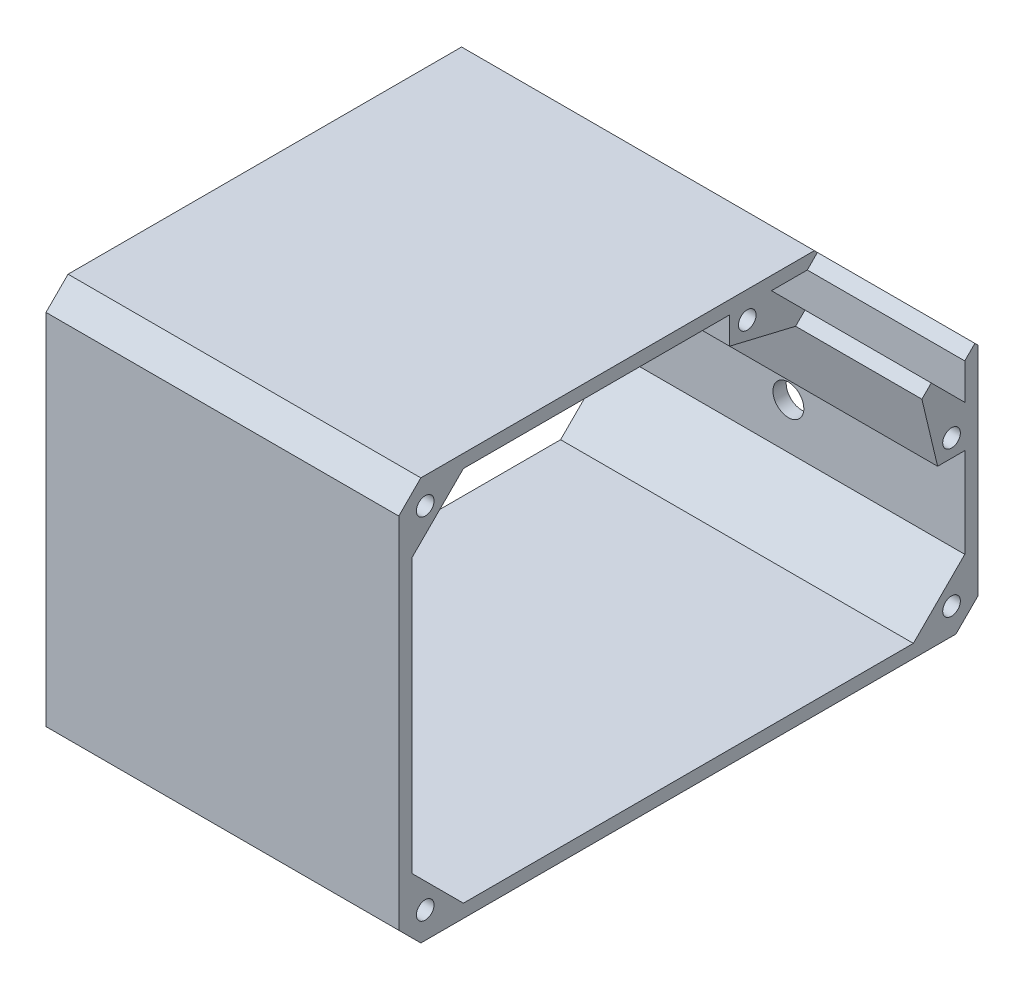
ISO-10303-21;
HEADER;
FILE_DESCRIPTION(('STEP AP214'),'2;1');
FILE_NAME('part.step','',(''),(''),'','','');
FILE_SCHEMA(('AUTOMOTIVE_DESIGN { 1 0 10303 214 1 1 1 1 }'));
ENDSEC;
DATA;
#1=APPLICATION_CONTEXT('core data for automotive mechanical design processes');
#2=APPLICATION_PROTOCOL_DEFINITION('international standard','automotive_design',2000,#1);
#3=PRODUCT_CONTEXT('',#1,'mechanical');
#4=PRODUCT('Part','Part','',(#3));
#5=PRODUCT_RELATED_PRODUCT_CATEGORY('part','',(#4));
#6=PRODUCT_DEFINITION_FORMATION('','',#4);
#7=PRODUCT_DEFINITION_CONTEXT('part definition',#1,'design');
#8=PRODUCT_DEFINITION('design','',#6,#7);
#9=PRODUCT_DEFINITION_SHAPE('','',#8);
#10=(LENGTH_UNIT() NAMED_UNIT(*) SI_UNIT(.MILLI.,.METRE.));
#11=(NAMED_UNIT(*) PLANE_ANGLE_UNIT() SI_UNIT($,.RADIAN.));
#12=(NAMED_UNIT(*) SI_UNIT($,.STERADIAN.) SOLID_ANGLE_UNIT());
#13=UNCERTAINTY_MEASURE_WITH_UNIT(LENGTH_MEASURE(1.E-05),#10,'distance_accuracy_value','');
#14=(GEOMETRIC_REPRESENTATION_CONTEXT(3) GLOBAL_UNCERTAINTY_ASSIGNED_CONTEXT((#13)) GLOBAL_UNIT_ASSIGNED_CONTEXT((#10,
#11,#12)) REPRESENTATION_CONTEXT('',''));
#15=CARTESIAN_POINT('',(0.,0.,0.));
#16=DIRECTION('',(0.,0.,1.));
#17=DIRECTION('',(1.,0.,0.));
#18=AXIS2_PLACEMENT_3D('',#15,#16,#17);
#19=CARTESIAN_POINT('',(80.,36.0491676970987,-8.58344636910614));
#20=DIRECTION('',(0.,0.972804322406935,-0.231628474731376));
#21=DIRECTION('',(0.,0.231628474731376,0.972804322406935));
#22=AXIS2_PLACEMENT_3D('',#19,#20,#21);
#23=PLANE('',#22);
#24=DIRECTION('',(0.,-0.231628474731376,-0.972804322406935));
#25=VECTOR('',#24,1.);
#26=CARTESIAN_POINT('',(0.,36.0491676970987,-8.58344636910614));
#27=LINE('',#26,#25);
#28=CARTESIAN_POINT('',(0.,29.5782965949916,-35.7601196393858));
#29=VERTEX_POINT('',#28);
#30=CARTESIAN_POINT('',(0.,26.0149867056768,-50.7254785678203));
#31=VERTEX_POINT('',#30);
#32=EDGE_CURVE('E250',#29,#31,#27,.T.);
#33=ORIENTED_EDGE('',*,*,#32,.T.);
#34=DIRECTION('',(-1.,0.,0.));
#35=VECTOR('',#34,1.);
#36=CARTESIAN_POINT('',(80.,26.0149867056768,-50.7254785678203));
#37=LINE('',#36,#35);
#38=CARTESIAN_POINT('',(80.,26.0149867056768,-50.7254785678203));
#39=VERTEX_POINT('',#38);
#40=EDGE_CURVE('E230',#39,#31,#37,.T.);
#41=ORIENTED_EDGE('',*,*,#40,.F.);
#42=DIRECTION('',(0.,-0.231628474731376,-0.972804322406935));
#43=VECTOR('',#42,1.);
#44=CARTESIAN_POINT('',(80.,36.0491676970987,-8.58344636910614));
#45=LINE('',#44,#43);
#46=CARTESIAN_POINT('',(80.,29.5782965949916,-35.7601196393858));
#47=VERTEX_POINT('',#46);
#48=EDGE_CURVE('E236',#47,#39,#45,.T.);
#49=ORIENTED_EDGE('',*,*,#48,.F.);
#50=DIRECTION('',(-1.,0.,0.));
#51=VECTOR('',#50,1.);
#52=CARTESIAN_POINT('',(80.,29.5782965949916,-35.7601196393858));
#53=LINE('',#52,#51);
#54=EDGE_CURVE('E392',#47,#29,#53,.T.);
#55=ORIENTED_EDGE('',*,*,#54,.T.);
#56=EDGE_LOOP('',(#33,#41,#49,#55));
#57=FACE_BOUND('',#56,.T.);
#58=ADVANCED_FACE('F40',(#57),#23,.F.);
#59=CARTESIAN_POINT('',(80.,-12.3552459310717,-12.3552459310717));
#60=DIRECTION('',(0.,0.707106781186548,0.707106781186547));
#61=DIRECTION('',(0.,-0.707106781186547,0.707106781186548));
#62=AXIS2_PLACEMENT_3D('',#59,#60,#61);
#63=PLANE('',#62);
#64=DIRECTION('',(0.,0.707106781186547,-0.707106781186548));
#65=VECTOR('',#64,1.);
#66=CARTESIAN_POINT('',(0.,-12.3552459310717,-12.3552459310717));
#67=LINE('',#66,#65);
#68=CARTESIAN_POINT('',(0.,28.1363070492364,-52.8467989113799));
#69=VERTEX_POINT('',#68);
#70=EDGE_CURVE('E452',#31,#69,#67,.T.);
#71=ORIENTED_EDGE('',*,*,#70,.T.);
#72=DIRECTION('',(-1.,0.,0.));
#73=VECTOR('',#72,1.);
#74=CARTESIAN_POINT('',(80.,28.1363070492364,-52.8467989113799));
#75=LINE('',#74,#73);
#76=CARTESIAN_POINT('',(80.,28.1363070492364,-52.8467989113799));
#77=VERTEX_POINT('',#76);
#78=EDGE_CURVE('E233',#77,#69,#75,.T.);
#79=ORIENTED_EDGE('',*,*,#78,.F.);
#80=DIRECTION('',(0.,0.707106781186547,-0.707106781186548));
#81=VECTOR('',#80,1.);
#82=CARTESIAN_POINT('',(80.,-12.3552459310717,-12.3552459310717));
#83=LINE('',#82,#81);
#84=EDGE_CURVE('E226',#39,#77,#83,.T.);
#85=ORIENTED_EDGE('',*,*,#84,.F.);
#86=ORIENTED_EDGE('',*,*,#40,.T.);
#87=EDGE_LOOP('',(#71,#79,#85,#86));
#88=FACE_BOUND('',#87,.T.);
#89=ADVANCED_FACE('F228',(#88),#63,.F.);
#90=CARTESIAN_POINT('',(80.,40.4915529803082,-40.4915529803081));
#91=DIRECTION('',(0.,-0.707106781186548,0.707106781186547));
#92=DIRECTION('',(0.,-0.707106781186547,-0.707106781186548));
#93=AXIS2_PLACEMENT_3D('',#90,#91,#92);
#94=PLANE('',#93);
#95=DIRECTION('',(0.,0.707106781186547,0.707106781186548));
#96=VECTOR('',#95,1.);
#97=CARTESIAN_POINT('',(0.,40.4915529803082,-40.4915529803081));
#98=LINE('',#97,#96);
#99=CARTESIAN_POINT('',(0.,35.7377049469919,-45.2454010136245));
#100=VERTEX_POINT('',#99);
#101=EDGE_CURVE('E447',#69,#100,#98,.T.);
#102=ORIENTED_EDGE('',*,*,#101,.T.);
#103=DIRECTION('',(-1.,0.,0.));
#104=VECTOR('',#103,1.);
#105=CARTESIAN_POINT('',(80.,35.7377049469919,-45.2454010136245));
#106=LINE('',#105,#104);
#107=CARTESIAN_POINT('',(80.,35.7377049469919,-45.2454010136245));
#108=VERTEX_POINT('',#107);
#109=EDGE_CURVE('E256',#108,#100,#106,.T.);
#110=ORIENTED_EDGE('',*,*,#109,.F.);
#111=DIRECTION('',(0.,0.707106781186547,0.707106781186548));
#112=VECTOR('',#111,1.);
#113=CARTESIAN_POINT('',(80.,40.4915529803082,-40.4915529803081));
#114=LINE('',#113,#112);
#115=EDGE_CURVE('E235',#77,#108,#114,.T.);
#116=ORIENTED_EDGE('',*,*,#115,.F.);
#117=ORIENTED_EDGE('',*,*,#78,.T.);
#118=EDGE_LOOP('',(#102,#110,#116,#117));
#119=FACE_BOUND('',#118,.T.);
#120=ADVANCED_FACE('F583',(#119),#94,.F.);
#121=CARTESIAN_POINT('',(80.,35.7377049469923,-3.457751985374E-13));
#122=DIRECTION('',(0.,1.,0.));
#123=DIRECTION('',(0.,0.,1.));
#124=AXIS2_PLACEMENT_3D('',#121,#122,#123);
#125=PLANE('',#124);
#126=DIRECTION('',(0.,0.,-1.));
#127=VECTOR('',#126,1.);
#128=CARTESIAN_POINT('',(0.,35.7377049469923,-3.457751985374E-13));
#129=LINE('',#128,#127);
#130=CARTESIAN_POINT('',(0.,35.7377049469918,-53.3771289972699));
#131=VERTEX_POINT('',#130);
#132=EDGE_CURVE('E442',#100,#131,#129,.T.);
#133=ORIENTED_EDGE('',*,*,#132,.T.);
#134=DIRECTION('',(-1.,0.,0.));
#135=VECTOR('',#134,1.);
#136=CARTESIAN_POINT('',(80.,35.7377049469918,-53.3771289972699));
#137=LINE('',#136,#135);
#138=CARTESIAN_POINT('',(80.,35.7377049469918,-53.3771289972699));
#139=VERTEX_POINT('',#138);
#140=EDGE_CURVE('E433',#139,#131,#137,.T.);
#141=ORIENTED_EDGE('',*,*,#140,.F.);
#142=DIRECTION('',(0.,0.,-1.));
#143=VECTOR('',#142,1.);
#144=CARTESIAN_POINT('',(80.,35.7377049469923,-3.457751985374E-13));
#145=LINE('',#144,#143);
#146=EDGE_CURVE('E443',#108,#139,#145,.T.);
#147=ORIENTED_EDGE('',*,*,#146,.F.);
#148=ORIENTED_EDGE('',*,*,#109,.T.);
#149=EDGE_LOOP('',(#133,#141,#147,#148));
#150=FACE_BOUND('',#149,.T.);
#151=ADVANCED_FACE('F440',(#150),#125,.F.);
#152=CARTESIAN_POINT('',(80.,-8.81971202513951,-8.81971202513975));
#153=DIRECTION('',(0.,0.707106781186538,0.707106781186557));
#154=DIRECTION('',(0.,-0.707106781186557,0.707106781186538));
#155=AXIS2_PLACEMENT_3D('',#152,#153,#154);
#156=PLANE('',#155);
#157=DIRECTION('',(0.,0.707106781186557,-0.707106781186538));
#158=VECTOR('',#157,1.);
#159=CARTESIAN_POINT('',(0.,-8.81971202513951,-8.81971202513975));
#160=LINE('',#159,#158);
#161=CARTESIAN_POINT('',(0.,38.0358019858481,-55.6752260361261));
#162=VERTEX_POINT('',#161);
#163=EDGE_CURVE('E449',#131,#162,#160,.T.);
#164=ORIENTED_EDGE('',*,*,#163,.T.);
#165=DIRECTION('',(-1.,0.,0.));
#166=VECTOR('',#165,1.);
#167=CARTESIAN_POINT('',(80.,38.0358019858481,-55.6752260361261));
#168=LINE('',#167,#166);
#169=CARTESIAN_POINT('',(80.,38.0358019858481,-55.6752260361261));
#170=VERTEX_POINT('',#169);
#171=EDGE_CURVE('E430',#170,#162,#168,.T.);
#172=ORIENTED_EDGE('',*,*,#171,.F.);
#173=DIRECTION('',(0.,0.707106781186557,-0.707106781186538));
#174=VECTOR('',#173,1.);
#175=CARTESIAN_POINT('',(80.,-8.81971202513951,-8.81971202513975));
#176=LINE('',#175,#174);
#177=EDGE_CURVE('E535',#139,#170,#176,.T.);
#178=ORIENTED_EDGE('',*,*,#177,.F.);
#179=ORIENTED_EDGE('',*,*,#140,.T.);
#180=EDGE_LOOP('',(#164,#172,#178,#179));
#181=FACE_BOUND('',#180,.T.);
#182=ADVANCED_FACE('F595',(#181),#156,.F.);
#183=CARTESIAN_POINT('',(80.,46.8555140109875,-46.8555140109865));
#184=DIRECTION('',(0.,-0.707106781186555,0.707106781186541));
#185=DIRECTION('',(0.,-0.707106781186541,-0.707106781186555));
#186=AXIS2_PLACEMENT_3D('',#183,#184,#185);
#187=PLANE('',#186);
#188=DIRECTION('',(0.,0.707106781186541,0.707106781186555));
#189=VECTOR('',#188,1.);
#190=CARTESIAN_POINT('',(0.,46.8555140109875,-46.8555140109865));
#191=LINE('',#190,#189);
#192=CARTESIAN_POINT('',(0.,38.7377049469918,-54.9733230749824));
#193=VERTEX_POINT('',#192);
#194=EDGE_CURVE('E332',#162,#193,#191,.T.);
#195=ORIENTED_EDGE('',*,*,#194,.T.);
#196=DIRECTION('',(-1.,0.,0.));
#197=VECTOR('',#196,1.);
#198=CARTESIAN_POINT('',(80.,38.7377049469918,-54.9733230749824));
#199=LINE('',#198,#197);
#200=CARTESIAN_POINT('',(80.,38.7377049469918,-54.9733230749824));
#201=VERTEX_POINT('',#200);
#202=EDGE_CURVE('E427',#201,#193,#199,.T.);
#203=ORIENTED_EDGE('',*,*,#202,.F.);
#204=DIRECTION('',(0.,0.707106781186541,0.707106781186555));
#205=VECTOR('',#204,1.);
#206=CARTESIAN_POINT('',(80.,46.8555140109875,-46.8555140109865));
#207=LINE('',#206,#205);
#208=EDGE_CURVE('E532',#170,#201,#207,.T.);
#209=ORIENTED_EDGE('',*,*,#208,.F.);
#210=ORIENTED_EDGE('',*,*,#171,.T.);
#211=EDGE_LOOP('',(#195,#203,#209,#210));
#212=FACE_BOUND('',#211,.T.);
#213=ADVANCED_FACE('F598',(#212),#187,.F.);
#214=CARTESIAN_POINT('',(80.,38.7377049469923,-3.67931014395659E-13));
#215=DIRECTION('',(0.,1.,0.));
#216=DIRECTION('',(0.,0.,1.));
#217=AXIS2_PLACEMENT_3D('',#214,#215,#216);
#218=PLANE('',#217);
#219=DIRECTION('',(0.,0.,-1.));
#220=VECTOR('',#219,1.);
#221=CARTESIAN_POINT('',(0.,38.7377049469923,-3.67931014395659E-13));
#222=LINE('',#221,#220);
#223=CARTESIAN_POINT('',(0.,38.7377049469927,34.2693176121369));
#224=VERTEX_POINT('',#223);
#225=EDGE_CURVE('E328',#224,#193,#222,.T.);
#226=ORIENTED_EDGE('',*,*,#225,.F.);
#227=DIRECTION('',(1.,0.,0.));
#228=VECTOR('',#227,1.);
#229=CARTESIAN_POINT('',(80.,38.7377049469927,34.2693176121369));
#230=LINE('',#229,#228);
#231=CARTESIAN_POINT('',(80.,38.7377049469927,34.2693176121369));
#232=VERTEX_POINT('',#231);
#233=EDGE_CURVE('E11',#224,#232,#230,.T.);
#234=ORIENTED_EDGE('',*,*,#233,.T.);
#235=DIRECTION('',(0.,0.,-1.));
#236=VECTOR('',#235,1.);
#237=CARTESIAN_POINT('',(80.,38.7377049469923,-3.67931014395659E-13));
#238=LINE('',#237,#236);
#239=EDGE_CURVE('E530',#232,#201,#238,.T.);
#240=ORIENTED_EDGE('',*,*,#239,.T.);
#241=ORIENTED_EDGE('',*,*,#202,.T.);
#242=EDGE_LOOP('',(#226,#234,#240,#241));
#243=FACE_BOUND('',#242,.T.);
#244=ADVANCED_FACE('F602',(#243),#218,.T.);
#245=CARTESIAN_POINT('',(80.,0.,39.2693176121369));
#246=DIRECTION('',(0.,0.,1.));
#247=DIRECTION('',(1.,0.,0.));
#248=AXIS2_PLACEMENT_3D('',#245,#246,#247);
#249=PLANE('',#248);
#250=DIRECTION('',(0.,1.,0.));
#251=VECTOR('',#250,1.);
#252=CARTESIAN_POINT('',(0.,0.,39.2693176121369));
#253=LINE('',#252,#251);
#254=CARTESIAN_POINT('',(0.,-47.6176341123355,39.2693176121369));
#255=VERTEX_POINT('',#254);
#256=CARTESIAN_POINT('',(0.,33.7377049469928,39.2693176121369));
#257=VERTEX_POINT('',#256);
#258=EDGE_CURVE('E318',#255,#257,#253,.T.);
#259=ORIENTED_EDGE('',*,*,#258,.F.);
#260=DIRECTION('',(1.,0.,0.));
#261=VECTOR('',#260,1.);
#262=CARTESIAN_POINT('',(80.,-47.6176341123355,39.2693176121369));
#263=LINE('',#262,#261);
#264=CARTESIAN_POINT('',(80.,-47.6176341123355,39.2693176121369));
#265=VERTEX_POINT('',#264);
#266=EDGE_CURVE('E49',#255,#265,#263,.T.);
#267=ORIENTED_EDGE('',*,*,#266,.T.);
#268=DIRECTION('',(0.,1.,0.));
#269=VECTOR('',#268,1.);
#270=CARTESIAN_POINT('',(80.,0.,39.2693176121369));
#271=LINE('',#270,#269);
#272=CARTESIAN_POINT('',(80.,33.7377049469928,39.2693176121369));
#273=VERTEX_POINT('',#272);
#274=EDGE_CURVE('E319',#265,#273,#271,.T.);
#275=ORIENTED_EDGE('',*,*,#274,.T.);
#276=DIRECTION('',(-1.,0.,0.));
#277=VECTOR('',#276,1.);
#278=CARTESIAN_POINT('',(80.,33.7377049469928,39.2693176121369));
#279=LINE('',#278,#277);
#280=EDGE_CURVE('E313',#273,#257,#279,.T.);
#281=ORIENTED_EDGE('',*,*,#280,.T.);
#282=EDGE_LOOP('',(#259,#267,#275,#281));
#283=FACE_BOUND('',#282,.T.);
#284=ADVANCED_FACE('F317',(#283),#249,.T.);
#285=CARTESIAN_POINT('',(80.,-52.6176341123356,0.));
#286=DIRECTION('',(0.,-1.,0.));
#287=DIRECTION('',(0.,0.,-1.));
#288=AXIS2_PLACEMENT_3D('',#285,#286,#287);
#289=PLANE('',#288);
#290=DIRECTION('',(0.,0.,1.));
#291=VECTOR('',#290,1.);
#292=CARTESIAN_POINT('',(0.,-52.6176341123356,0.));
#293=LINE('',#292,#291);
#294=CARTESIAN_POINT('',(0.,-52.6176341123356,-87.0860214471905));
#295=VERTEX_POINT('',#294);
#296=CARTESIAN_POINT('',(0.,-52.6176341123356,34.2693176121369));
#297=VERTEX_POINT('',#296);
#298=EDGE_CURVE('E327',#295,#297,#293,.T.);
#299=ORIENTED_EDGE('',*,*,#298,.F.);
#300=DIRECTION('',(1.,0.,0.));
#301=VECTOR('',#300,1.);
#302=CARTESIAN_POINT('',(80.,-52.6176341123356,-87.0860214471905));
#303=LINE('',#302,#301);
#304=CARTESIAN_POINT('',(80.,-52.6176341123356,-87.0860214471905));
#305=VERTEX_POINT('',#304);
#306=EDGE_CURVE('E306',#295,#305,#303,.T.);
#307=ORIENTED_EDGE('',*,*,#306,.T.);
#308=DIRECTION('',(0.,0.,1.));
#309=VECTOR('',#308,1.);
#310=CARTESIAN_POINT('',(80.,-52.6176341123356,0.));
#311=LINE('',#310,#309);
#312=CARTESIAN_POINT('',(80.,-52.6176341123356,34.2693176121369));
#313=VERTEX_POINT('',#312);
#314=EDGE_CURVE('E526',#305,#313,#311,.T.);
#315=ORIENTED_EDGE('',*,*,#314,.T.);
#316=DIRECTION('',(-1.,0.,0.));
#317=VECTOR('',#316,1.);
#318=CARTESIAN_POINT('',(80.,-52.6176341123356,34.2693176121369));
#319=LINE('',#318,#317);
#320=EDGE_CURVE('E303',#313,#297,#319,.T.);
#321=ORIENTED_EDGE('',*,*,#320,.T.);
#322=EDGE_LOOP('',(#299,#307,#315,#321));
#323=FACE_BOUND('',#322,.T.);
#324=ADVANCED_FACE('F555',(#323),#289,.T.);
#325=CARTESIAN_POINT('',(80.,0.,-92.0860214471905));
#326=DIRECTION('',(0.,0.,-1.));
#327=DIRECTION('',(-1.,0.,0.));
#328=AXIS2_PLACEMENT_3D('',#325,#326,#327);
#329=PLANE('',#328);
#330=CARTESIAN_POINT('',(40.,-27.6176341123355,-92.0860214471905));
#331=DIRECTION('',(0.,0.,-1.));
#332=DIRECTION('',(-1.,0.,0.));
#333=AXIS2_PLACEMENT_3D('',#330,#331,#332);
#334=CIRCLE('',#333,3.5);
#335=CARTESIAN_POINT('',(36.5,-27.6176341123355,-92.0860214471905));
#336=VERTEX_POINT('',#335);
#337=EDGE_CURVE('E464',#336,#336,#334,.T.);
#338=ORIENTED_EDGE('',*,*,#337,.F.);
#339=EDGE_LOOP('',(#338));
#340=FACE_BOUND('',#339,.T.);
#341=DIRECTION('',(0.,-1.,0.));
#342=VECTOR('',#341,1.);
#343=CARTESIAN_POINT('',(80.,0.,-92.0860214471905));
#344=LINE('',#343,#342);
#345=CARTESIAN_POINT('',(80.,1.62500657478374,-92.0860214471905));
#346=VERTEX_POINT('',#345);
#347=CARTESIAN_POINT('',(80.,-47.6176341123356,-92.0860214471905));
#348=VERTEX_POINT('',#347);
#349=EDGE_CURVE('E523',#346,#348,#344,.T.);
#350=ORIENTED_EDGE('',*,*,#349,.T.);
#351=DIRECTION('',(-1.,0.,0.));
#352=VECTOR('',#351,1.);
#353=CARTESIAN_POINT('',(80.,-47.6176341123356,-92.0860214471905));
#354=LINE('',#353,#352);
#355=CARTESIAN_POINT('',(0.,-47.6176341123356,-92.0860214471905));
#356=VERTEX_POINT('',#355);
#357=EDGE_CURVE('E251',#348,#356,#354,.T.);
#358=ORIENTED_EDGE('',*,*,#357,.T.);
#359=DIRECTION('',(0.,-1.,0.));
#360=VECTOR('',#359,1.);
#361=CARTESIAN_POINT('',(0.,0.,-92.0860214471905));
#362=LINE('',#361,#360);
#363=CARTESIAN_POINT('',(0.,1.62500657478374,-92.0860214471905));
#364=VERTEX_POINT('',#363);
#365=EDGE_CURVE('E330',#364,#356,#362,.T.);
#366=ORIENTED_EDGE('',*,*,#365,.F.);
#367=DIRECTION('',(-1.,0.,0.));
#368=VECTOR('',#367,1.);
#369=CARTESIAN_POINT('',(80.,1.62500657478374,-92.0860214471905));
#370=LINE('',#369,#368);
#371=EDGE_CURVE('E425',#346,#364,#370,.T.);
#372=ORIENTED_EDGE('',*,*,#371,.F.);
#373=EDGE_LOOP('',(#350,#358,#366,#372));
#374=FACE_BOUND('',#373,.T.);
#375=ADVANCED_FACE('F551',(#340,#374),#329,.T.);
#376=CARTESIAN_POINT('',(80.,46.8555140109863,-46.8555140110324));
#377=DIRECTION('',(0.,0.7071067811862,-0.707106781186895));
#378=DIRECTION('',(0.,0.707106781186895,0.7071067811862));
#379=AXIS2_PLACEMENT_3D('',#376,#377,#378);
#380=PLANE('',#379);
#381=DIRECTION('',(0.,-0.707106781186895,-0.7071067811862));
#382=VECTOR('',#381,1.);
#383=CARTESIAN_POINT('',(0.,46.8555140109863,-46.8555140110324));
#384=LINE('',#383,#382);
#385=CARTESIAN_POINT('',(0.,2.32690953592785,-91.3841184860471));
#386=VERTEX_POINT('',#385);
#387=EDGE_CURVE('E337',#386,#364,#384,.T.);
#388=ORIENTED_EDGE('',*,*,#387,.F.);
#389=DIRECTION('',(-1.,0.,0.));
#390=VECTOR('',#389,1.);
#391=CARTESIAN_POINT('',(80.,2.32690953592785,-91.3841184860471));
#392=LINE('',#391,#390);
#393=CARTESIAN_POINT('',(80.,2.32690953592785,-91.3841184860471));
#394=VERTEX_POINT('',#393);
#395=EDGE_CURVE('E423',#394,#386,#392,.T.);
#396=ORIENTED_EDGE('',*,*,#395,.F.);
#397=DIRECTION('',(0.,-0.707106781186895,-0.7071067811862));
#398=VECTOR('',#397,1.);
#399=CARTESIAN_POINT('',(80.,46.8555140109863,-46.8555140110324));
#400=LINE('',#399,#398);
#401=EDGE_CURVE('E520',#394,#346,#400,.T.);
#402=ORIENTED_EDGE('',*,*,#401,.T.);
#403=ORIENTED_EDGE('',*,*,#371,.T.);
#404=EDGE_LOOP('',(#388,#396,#402,#403));
#405=FACE_BOUND('',#404,.T.);
#406=ADVANCED_FACE('F554',(#405),#380,.T.);
#407=CARTESIAN_POINT('',(80.,-44.5286044750597,-44.5286044750612));
#408=DIRECTION('',(0.,0.707106781186535,0.70710678118656));
#409=DIRECTION('',(0.,-0.70710678118656,0.707106781186535));
#410=AXIS2_PLACEMENT_3D('',#407,#408,#409);
#411=PLANE('',#410);
#412=DIRECTION('',(0.,0.70710678118656,-0.707106781186535));
#413=VECTOR('',#412,1.);
#414=CARTESIAN_POINT('',(0.,-44.5286044750597,-44.5286044750612));
#415=LINE('',#414,#413);
#416=CARTESIAN_POINT('',(0.,0.0288124970711651,-89.0860214471905));
#417=VERTEX_POINT('',#416);
#418=EDGE_CURVE('E340',#417,#386,#415,.T.);
#419=ORIENTED_EDGE('',*,*,#418,.F.);
#420=DIRECTION('',(-1.,0.,0.));
#421=VECTOR('',#420,1.);
#422=CARTESIAN_POINT('',(80.,0.0288124970711651,-89.0860214471905));
#423=LINE('',#422,#421);
#424=CARTESIAN_POINT('',(80.,0.0288124970711651,-89.0860214471905));
#425=VERTEX_POINT('',#424);
#426=EDGE_CURVE('E421',#425,#417,#423,.T.);
#427=ORIENTED_EDGE('',*,*,#426,.F.);
#428=DIRECTION('',(0.,0.70710678118656,-0.707106781186535));
#429=VECTOR('',#428,1.);
#430=CARTESIAN_POINT('',(80.,-44.5286044750597,-44.5286044750612));
#431=LINE('',#430,#429);
#432=EDGE_CURVE('E517',#425,#394,#431,.T.);
#433=ORIENTED_EDGE('',*,*,#432,.T.);
#434=ORIENTED_EDGE('',*,*,#395,.T.);
#435=EDGE_LOOP('',(#419,#427,#433,#434));
#436=FACE_BOUND('',#435,.T.);
#437=ADVANCED_FACE('F612',(#436),#411,.T.);
#438=CARTESIAN_POINT('',(80.,0.,-89.0860214471905));
#439=DIRECTION('',(0.,0.,1.));
#440=DIRECTION('',(0.,-1.,0.));
#441=AXIS2_PLACEMENT_3D('',#438,#439,#440);
#442=PLANE('',#441);
#443=DIRECTION('',(0.,1.,0.));
#444=VECTOR('',#443,1.);
#445=CARTESIAN_POINT('',(0.,0.,-89.0860214471905));
#446=LINE('',#445,#444);
#447=CARTESIAN_POINT('',(0.,-8.10291548657412,-89.0860214471905));
#448=VERTEX_POINT('',#447);
#449=EDGE_CURVE('E343',#448,#417,#446,.T.);
#450=ORIENTED_EDGE('',*,*,#449,.F.);
#451=DIRECTION('',(-1.,0.,0.));
#452=VECTOR('',#451,1.);
#453=CARTESIAN_POINT('',(80.,-8.10291548657412,-89.0860214471905));
#454=LINE('',#453,#452);
#455=CARTESIAN_POINT('',(80.,-8.10291548657412,-89.0860214471905));
#456=VERTEX_POINT('',#455);
#457=EDGE_CURVE('E419',#456,#448,#454,.T.);
#458=ORIENTED_EDGE('',*,*,#457,.F.);
#459=DIRECTION('',(0.,1.,0.));
#460=VECTOR('',#459,1.);
#461=CARTESIAN_POINT('',(80.,0.,-89.0860214471905));
#462=LINE('',#461,#460);
#463=EDGE_CURVE('E514',#456,#425,#462,.T.);
#464=ORIENTED_EDGE('',*,*,#463,.T.);
#465=ORIENTED_EDGE('',*,*,#426,.T.);
#466=EDGE_LOOP('',(#450,#458,#464,#465));
#467=FACE_BOUND('',#466,.T.);
#468=ADVANCED_FACE('F615',(#467),#442,.T.);
#469=CARTESIAN_POINT('',(80.,40.4915529803082,-40.491552980308));
#470=DIRECTION('',(0.,0.707106781186549,-0.707106781186546));
#471=DIRECTION('',(0.,0.707106781186546,0.707106781186549));
#472=AXIS2_PLACEMENT_3D('',#469,#470,#471);
#473=PLANE('',#472);
#474=DIRECTION('',(0.,-0.707106781186546,-0.707106781186549));
#475=VECTOR('',#474,1.);
#476=CARTESIAN_POINT('',(0.,40.4915529803082,-40.491552980308));
#477=LINE('',#476,#475);
#478=CARTESIAN_POINT('',(0.,-0.501173591601692,-81.4842795522181));
#479=VERTEX_POINT('',#478);
#480=EDGE_CURVE('E346',#479,#448,#477,.T.);
#481=ORIENTED_EDGE('',*,*,#480,.F.);
#482=DIRECTION('',(-1.,0.,0.));
#483=VECTOR('',#482,1.);
#484=CARTESIAN_POINT('',(80.,-0.501173591601692,-81.4842795522181));
#485=LINE('',#484,#483);
#486=CARTESIAN_POINT('',(80.,-0.501173591601692,-81.4842795522181));
#487=VERTEX_POINT('',#486);
#488=EDGE_CURVE('E417',#487,#479,#485,.T.);
#489=ORIENTED_EDGE('',*,*,#488,.F.);
#490=DIRECTION('',(0.,-0.707106781186546,-0.707106781186549));
#491=VECTOR('',#490,1.);
#492=CARTESIAN_POINT('',(80.,40.4915529803082,-40.491552980308));
#493=LINE('',#492,#491);
#494=EDGE_CURVE('E511',#487,#456,#493,.T.);
#495=ORIENTED_EDGE('',*,*,#494,.T.);
#496=ORIENTED_EDGE('',*,*,#457,.T.);
#497=EDGE_LOOP('',(#481,#489,#495,#496));
#498=FACE_BOUND('',#497,.T.);
#499=ADVANCED_FACE('F287',(#498),#473,.T.);
#500=CARTESIAN_POINT('',(80.,-40.9927265719099,-40.99272657191));
#501=DIRECTION('',(0.,0.707106781186546,0.707106781186549));
#502=DIRECTION('',(0.,-0.707106781186549,0.707106781186546));
#503=AXIS2_PLACEMENT_3D('',#500,#501,#502);
#504=PLANE('',#503);
#505=DIRECTION('',(0.,0.707106781186549,-0.707106781186546));
#506=VECTOR('',#505,1.);
#507=CARTESIAN_POINT('',(0.,-40.9927265719099,-40.99272657191));
#508=LINE('',#507,#506);
#509=CARTESIAN_POINT('',(0.,-2.62257486543383,-79.3630955164268));
#510=VERTEX_POINT('',#509);
#511=EDGE_CURVE('E350',#510,#479,#508,.T.);
#512=ORIENTED_EDGE('',*,*,#511,.F.);
#513=CARTESIAN_POINT('',(80.,-2.62254218094244,-79.3632327863135));
#514=DIRECTION('',(-1.,0.,0.));
#515=VECTOR('',#514,1.);
#516=LINE('',#513,#515);
#517=CARTESIAN_POINT('',(80.,-2.62257486543383,-79.3630955164268));
#518=VERTEX_POINT('',#517);
#519=EDGE_CURVE('E264',#518,#510,#516,.T.);
#520=ORIENTED_EDGE('',*,*,#519,.F.);
#521=DIRECTION('',(0.,0.707106781186549,-0.707106781186546));
#522=VECTOR('',#521,1.);
#523=CARTESIAN_POINT('',(80.,-40.9927265719099,-40.99272657191));
#524=LINE('',#523,#522);
#525=EDGE_CURVE('E506',#518,#487,#524,.T.);
#526=ORIENTED_EDGE('',*,*,#525,.T.);
#527=ORIENTED_EDGE('',*,*,#488,.T.);
#528=EDGE_LOOP('',(#512,#520,#526,#527));
#529=FACE_BOUND('',#528,.T.);
#530=ADVANCED_FACE('F282',(#529),#504,.T.);
#531=CARTESIAN_POINT('',(80.,17.7421482996267,-74.5143211545071));
#532=DIRECTION('',(0.,-0.231628474731368,0.972804322406937));
#533=DIRECTION('',(0.,-0.972804322406937,-0.231628474731368));
#534=AXIS2_PLACEMENT_3D('',#531,#532,#533);
#535=PLANE('',#534);
#536=DIRECTION('',(0.,0.972804322406937,0.231628474731368));
#537=VECTOR('',#536,1.);
#538=CARTESIAN_POINT('',(0.,17.7421482996267,-74.5143211545071));
#539=LINE('',#538,#537);
#540=CARTESIAN_POINT('',(0.,-17.5881968608129,-82.92661309519));
#541=VERTEX_POINT('',#540);
#542=EDGE_CURVE('E353',#541,#510,#539,.T.);
#543=ORIENTED_EDGE('',*,*,#542,.F.);
#544=DIRECTION('',(-1.,0.,0.));
#545=VECTOR('',#544,1.);
#546=CARTESIAN_POINT('',(80.,-17.5881968608129,-82.92661309519));
#547=LINE('',#546,#545);
#548=CARTESIAN_POINT('',(80.,-17.5881968608129,-82.92661309519));
#549=VERTEX_POINT('',#548);
#550=EDGE_CURVE('E415',#549,#541,#547,.T.);
#551=ORIENTED_EDGE('',*,*,#550,.F.);
#552=DIRECTION('',(0.,0.972804322406937,0.231628474731368));
#553=VECTOR('',#552,1.);
#554=CARTESIAN_POINT('',(80.,17.7421482996267,-74.5143211545071));
#555=LINE('',#554,#553);
#556=EDGE_CURVE('E502',#549,#518,#555,.T.);
#557=ORIENTED_EDGE('',*,*,#556,.T.);
#558=ORIENTED_EDGE('',*,*,#519,.T.);
#559=EDGE_LOOP('',(#543,#551,#557,#558));
#560=FACE_BOUND('',#559,.T.);
#561=ADVANCED_FACE('F271',(#560),#535,.T.);
#562=CARTESIAN_POINT('',(80.,-17.5881968608123,1.18884111918212E-13));
#563=DIRECTION('',(0.,-1.,0.));
#564=DIRECTION('',(0.,0.,-1.));
#565=AXIS2_PLACEMENT_3D('',#562,#563,#564);
#566=PLANE('',#565);
#567=DIRECTION('',(0.,0.,1.));
#568=VECTOR('',#567,1.);
#569=CARTESIAN_POINT('',(0.,-17.5881968608123,1.18884111918212E-13));
#570=LINE('',#569,#568);
#571=CARTESIAN_POINT('',(0.,-17.5881968608129,-89.0860214471905));
#572=VERTEX_POINT('',#571);
#573=EDGE_CURVE('E358',#572,#541,#570,.T.);
#574=ORIENTED_EDGE('',*,*,#573,.F.);
#575=DIRECTION('',(-1.,0.,0.));
#576=VECTOR('',#575,1.);
#577=CARTESIAN_POINT('',(80.,-17.5881968608129,-89.0860214471905));
#578=LINE('',#577,#576);
#579=CARTESIAN_POINT('',(80.,-17.5881968608129,-89.0860214471905));
#580=VERTEX_POINT('',#579);
#581=EDGE_CURVE('E413',#580,#572,#578,.T.);
#582=ORIENTED_EDGE('',*,*,#581,.F.);
#583=DIRECTION('',(0.,0.,1.));
#584=VECTOR('',#583,1.);
#585=CARTESIAN_POINT('',(80.,-17.5881968608123,1.18884111918212E-13));
#586=LINE('',#585,#584);
#587=EDGE_CURVE('E499',#580,#549,#586,.T.);
#588=ORIENTED_EDGE('',*,*,#587,.T.);
#589=ORIENTED_EDGE('',*,*,#550,.T.);
#590=EDGE_LOOP('',(#574,#582,#588,#589));
#591=FACE_BOUND('',#590,.T.);
#592=ADVANCED_FACE('F281',(#591),#566,.T.);
#593=CARTESIAN_POINT('',(40.,-27.6176341123355,-89.0860214471905));
#594=DIRECTION('',(0.,0.,1.));
#595=DIRECTION('',(0.,-1.,0.));
#596=AXIS2_PLACEMENT_3D('',#593,#594,#595);
#597=CIRCLE('',#596,3.5);
#598=CARTESIAN_POINT('',(40.,-31.1176341123355,-89.0860214471905));
#599=VERTEX_POINT('',#598);
#600=EDGE_CURVE('E468',#599,#599,#597,.F.);
#601=ORIENTED_EDGE('',*,*,#600,.T.);
#602=EDGE_LOOP('',(#601));
#603=FACE_BOUND('',#602,.T.);
#604=CARTESIAN_POINT('',(0.,-37.9607798628432,-89.0860214471905));
#605=VERTEX_POINT('',#604);
#606=EDGE_CURVE('E347',#605,#572,#446,.T.);
#607=ORIENTED_EDGE('',*,*,#606,.F.);
#608=DIRECTION('',(-1.,0.,0.));
#609=VECTOR('',#608,1.);
#610=CARTESIAN_POINT('',(80.,-37.9607798628432,-89.0860214471905));
#611=LINE('',#610,#609);
#612=CARTESIAN_POINT('',(80.,-37.9607798628432,-89.0860214471905));
#613=VERTEX_POINT('',#612);
#614=EDGE_CURVE('E411',#613,#605,#611,.T.);
#615=ORIENTED_EDGE('',*,*,#614,.F.);
#616=EDGE_CURVE('E498',#613,#580,#462,.T.);
#617=ORIENTED_EDGE('',*,*,#616,.T.);
#618=ORIENTED_EDGE('',*,*,#581,.T.);
#619=EDGE_LOOP('',(#607,#615,#617,#618));
#620=FACE_BOUND('',#619,.T.);
#621=ADVANCED_FACE('F542',(#603,#620),#442,.T.);
#622=CARTESIAN_POINT('',(80.,-63.5234006550167,-63.5234006550172));
#623=DIRECTION('',(0.,-0.707106781186544,-0.707106781186551));
#624=DIRECTION('',(0.,0.707106781186551,-0.707106781186544));
#625=AXIS2_PLACEMENT_3D('',#622,#623,#624);
#626=PLANE('',#625);
#627=DIRECTION('',(0.,-0.707106781186551,0.707106781186544));
#628=VECTOR('',#627,1.);
#629=CARTESIAN_POINT('',(0.,-63.5234006550167,-63.5234006550172));
#630=LINE('',#629,#628);
#631=CARTESIAN_POINT('',(0.,-49.6176341123356,-77.4291671976982));
#632=VERTEX_POINT('',#631);
#633=EDGE_CURVE('E363',#605,#632,#630,.T.);
#634=ORIENTED_EDGE('',*,*,#633,.T.);
#635=DIRECTION('',(-1.,0.,0.));
#636=VECTOR('',#635,1.);
#637=CARTESIAN_POINT('',(80.,-49.6176341123356,-77.4291671976982));
#638=LINE('',#637,#636);
#639=CARTESIAN_POINT('',(80.,-49.6176341123356,-77.4291671976982));
#640=VERTEX_POINT('',#639);
#641=EDGE_CURVE('E408',#640,#632,#638,.T.);
#642=ORIENTED_EDGE('',*,*,#641,.F.);
#643=DIRECTION('',(0.,-0.707106781186551,0.707106781186544));
#644=VECTOR('',#643,1.);
#645=CARTESIAN_POINT('',(80.,-63.5234006550167,-63.5234006550172));
#646=LINE('',#645,#644);
#647=EDGE_CURVE('E496',#613,#640,#646,.T.);
#648=ORIENTED_EDGE('',*,*,#647,.F.);
#649=ORIENTED_EDGE('',*,*,#614,.T.);
#650=EDGE_LOOP('',(#634,#642,#648,#649));
#651=FACE_BOUND('',#650,.T.);
#652=ADVANCED_FACE('F642',(#651),#626,.F.);
#653=CARTESIAN_POINT('',(80.,-49.6176341123356,0.));
#654=DIRECTION('',(0.,-1.,0.));
#655=DIRECTION('',(0.,0.,-1.));
#656=AXIS2_PLACEMENT_3D('',#653,#654,#655);
#657=PLANE('',#656);
#658=DIRECTION('',(0.,0.,1.));
#659=VECTOR('',#658,1.);
#660=CARTESIAN_POINT('',(0.,-49.6176341123356,0.));
#661=LINE('',#660,#659);
#662=CARTESIAN_POINT('',(0.,-49.6176341123356,24.6124633626445));
#663=VERTEX_POINT('',#662);
#664=EDGE_CURVE('E365',#632,#663,#661,.T.);
#665=ORIENTED_EDGE('',*,*,#664,.T.);
#666=DIRECTION('',(-1.,0.,0.));
#667=VECTOR('',#666,1.);
#668=CARTESIAN_POINT('',(80.,-49.6176341123356,24.6124633626445));
#669=LINE('',#668,#667);
#670=CARTESIAN_POINT('',(80.,-49.6176341123356,24.6124633626445));
#671=VERTEX_POINT('',#670);
#672=EDGE_CURVE('E406',#671,#663,#669,.T.);
#673=ORIENTED_EDGE('',*,*,#672,.F.);
#674=DIRECTION('',(0.,0.,1.));
#675=VECTOR('',#674,1.);
#676=CARTESIAN_POINT('',(80.,-49.6176341123356,0.));
#677=LINE('',#676,#675);
#678=EDGE_CURVE('E494',#640,#671,#677,.T.);
#679=ORIENTED_EDGE('',*,*,#678,.F.);
#680=ORIENTED_EDGE('',*,*,#641,.T.);
#681=EDGE_LOOP('',(#665,#673,#679,#680));
#682=FACE_BOUND('',#681,.T.);
#683=ADVANCED_FACE('F647',(#682),#657,.F.);
#684=CARTESIAN_POINT('',(80.,-37.1150487374898,37.1150487374902));
#685=DIRECTION('',(0.,0.707106781186544,-0.707106781186551));
#686=DIRECTION('',(0.,0.707106781186551,0.707106781186544));
#687=AXIS2_PLACEMENT_3D('',#684,#685,#686);
#688=PLANE('',#687);
#689=DIRECTION('',(0.,-0.707106781186551,-0.707106781186544));
#690=VECTOR('',#689,1.);
#691=CARTESIAN_POINT('',(0.,-37.1150487374898,37.1150487374902));
#692=LINE('',#691,#690);
#693=CARTESIAN_POINT('',(0.,-37.9607798628431,36.2693176121369));
#694=VERTEX_POINT('',#693);
#695=EDGE_CURVE('E368',#694,#663,#692,.T.);
#696=ORIENTED_EDGE('',*,*,#695,.F.);
#697=DIRECTION('',(-1.,0.,0.));
#698=VECTOR('',#697,1.);
#699=CARTESIAN_POINT('',(80.,-37.9607798628431,36.2693176121369));
#700=LINE('',#699,#698);
#701=CARTESIAN_POINT('',(80.,-37.9607798628431,36.2693176121369));
#702=VERTEX_POINT('',#701);
#703=EDGE_CURVE('E404',#702,#694,#700,.T.);
#704=ORIENTED_EDGE('',*,*,#703,.F.);
#705=DIRECTION('',(0.,-0.707106781186551,-0.707106781186544));
#706=VECTOR('',#705,1.);
#707=CARTESIAN_POINT('',(80.,-37.1150487374898,37.1150487374902));
#708=LINE('',#707,#706);
#709=EDGE_CURVE('E491',#702,#671,#708,.T.);
#710=ORIENTED_EDGE('',*,*,#709,.T.);
#711=ORIENTED_EDGE('',*,*,#672,.T.);
#712=EDGE_LOOP('',(#696,#704,#710,#711));
#713=FACE_BOUND('',#712,.T.);
#714=ADVANCED_FACE('F651',(#713),#688,.T.);
#715=CARTESIAN_POINT('',(80.,0.,36.2693176121369));
#716=DIRECTION('',(0.,0.,1.));
#717=DIRECTION('',(0.,-1.,0.));
#718=AXIS2_PLACEMENT_3D('',#715,#716,#717);
#719=PLANE('',#718);
#720=DIRECTION('',(0.,1.,0.));
#721=VECTOR('',#720,1.);
#722=CARTESIAN_POINT('',(0.,0.,36.2693176121369));
#723=LINE('',#722,#721);
#724=CARTESIAN_POINT('',(0.,24.0808506975003,36.2693176121369));
#725=VERTEX_POINT('',#724);
#726=EDGE_CURVE('E371',#694,#725,#723,.T.);
#727=ORIENTED_EDGE('',*,*,#726,.T.);
#728=DIRECTION('',(-1.,0.,0.));
#729=VECTOR('',#728,1.);
#730=CARTESIAN_POINT('',(80.,24.0808506975003,36.2693176121369));
#731=LINE('',#730,#729);
#732=CARTESIAN_POINT('',(80.,24.0808506975003,36.2693176121369));
#733=VERTEX_POINT('',#732);
#734=EDGE_CURVE('E401',#733,#725,#731,.T.);
#735=ORIENTED_EDGE('',*,*,#734,.F.);
#736=DIRECTION('',(0.,1.,0.));
#737=VECTOR('',#736,1.);
#738=CARTESIAN_POINT('',(80.,0.,36.2693176121369));
#739=LINE('',#738,#737);
#740=EDGE_CURVE('E489',#702,#733,#739,.T.);
#741=ORIENTED_EDGE('',*,*,#740,.F.);
#742=ORIENTED_EDGE('',*,*,#703,.T.);
#743=EDGE_LOOP('',(#727,#735,#741,#742));
#744=FACE_BOUND('',#743,.T.);
#745=ADVANCED_FACE('F656',(#744),#719,.F.);
#746=CARTESIAN_POINT('',(80.,30.1750841548185,30.1750841548186));
#747=DIRECTION('',(0.,0.707106781186546,0.707106781186549));
#748=DIRECTION('',(0.,-0.707106781186549,0.707106781186546));
#749=AXIS2_PLACEMENT_3D('',#746,#747,#748);
#750=PLANE('',#749);
#751=DIRECTION('',(0.,0.707106781186549,-0.707106781186546));
#752=VECTOR('',#751,1.);
#753=CARTESIAN_POINT('',(0.,30.1750841548185,30.1750841548186));
#754=LINE('',#753,#752);
#755=CARTESIAN_POINT('',(0.,35.7377049469926,24.6124633626446));
#756=VERTEX_POINT('',#755);
#757=EDGE_CURVE('E373',#725,#756,#754,.T.);
#758=ORIENTED_EDGE('',*,*,#757,.T.);
#759=DIRECTION('',(-1.,0.,0.));
#760=VECTOR('',#759,1.);
#761=CARTESIAN_POINT('',(80.,35.7377049469926,24.6124633626446));
#762=LINE('',#761,#760);
#763=CARTESIAN_POINT('',(80.,35.7377049469926,24.6124633626446));
#764=VERTEX_POINT('',#763);
#765=EDGE_CURVE('E398',#764,#756,#762,.T.);
#766=ORIENTED_EDGE('',*,*,#765,.F.);
#767=DIRECTION('',(0.,0.707106781186549,-0.707106781186546));
#768=VECTOR('',#767,1.);
#769=CARTESIAN_POINT('',(80.,30.1750841548185,30.1750841548186));
#770=LINE('',#769,#768);
#771=EDGE_CURVE('E487',#733,#764,#770,.T.);
#772=ORIENTED_EDGE('',*,*,#771,.F.);
#773=ORIENTED_EDGE('',*,*,#734,.T.);
#774=EDGE_LOOP('',(#758,#766,#772,#773));
#775=FACE_BOUND('',#774,.T.);
#776=ADVANCED_FACE('F659',(#775),#750,.F.);
#777=CARTESIAN_POINT('',(0.,35.737704946992,-35.7601196393858));
#778=VERTEX_POINT('',#777);
#779=EDGE_CURVE('E375',#756,#778,#129,.T.);
#780=ORIENTED_EDGE('',*,*,#779,.T.);
#781=DIRECTION('',(-1.,0.,0.));
#782=VECTOR('',#781,1.);
#783=CARTESIAN_POINT('',(80.,35.737704946992,-35.7601196393858));
#784=LINE('',#783,#782);
#785=CARTESIAN_POINT('',(80.,35.737704946992,-35.7601196393858));
#786=VERTEX_POINT('',#785);
#787=EDGE_CURVE('E394',#786,#778,#784,.T.);
#788=ORIENTED_EDGE('',*,*,#787,.F.);
#789=EDGE_CURVE('E486',#764,#786,#145,.T.);
#790=ORIENTED_EDGE('',*,*,#789,.F.);
#791=ORIENTED_EDGE('',*,*,#765,.T.);
#792=EDGE_LOOP('',(#780,#788,#790,#791));
#793=FACE_BOUND('',#792,.T.);
#794=ADVANCED_FACE('F457',(#793),#125,.F.);
#795=CARTESIAN_POINT('',(80.,-46.6176341123356,-86.0860214471905));
#796=DIRECTION('',(-1.,0.,0.));
#797=DIRECTION('',(0.,0.,1.));
#798=AXIS2_PLACEMENT_3D('',#795,#796,#797);
#799=CYLINDRICAL_SURFACE('',#798,1.99999999999998);
#800=CARTESIAN_POINT('',(80.,-46.6176341123356,-86.0860214471905));
#801=DIRECTION('',(1.,0.,0.));
#802=DIRECTION('',(0.,0.,-1.));
#803=AXIS2_PLACEMENT_3D('',#800,#801,#802);
#804=CIRCLE('',#803,1.99999999999998);
#805=CARTESIAN_POINT('',(80.,-46.6176341123356,-88.0860214471905));
#806=VERTEX_POINT('',#805);
#807=EDGE_CURVE('E473',#806,#806,#804,.F.);
#808=ORIENTED_EDGE('',*,*,#807,.F.);
#809=EDGE_LOOP('',(#808));
#810=FACE_BOUND('',#809,.T.);
#811=CARTESIAN_POINT('',(0.,-46.6176341123356,-86.0860214471905));
#812=DIRECTION('',(1.,0.,0.));
#813=DIRECTION('',(0.,0.,-1.));
#814=AXIS2_PLACEMENT_3D('',#811,#812,#813);
#815=CIRCLE('',#814,1.99999999999998);
#816=CARTESIAN_POINT('',(0.,-46.6176341123356,-88.0860214471905));
#817=VERTEX_POINT('',#816);
#818=EDGE_CURVE('E387',#817,#817,#815,.F.);
#819=ORIENTED_EDGE('',*,*,#818,.T.);
#820=EDGE_LOOP('',(#819));
#821=FACE_BOUND('',#820,.T.);
#822=ADVANCED_FACE('F666',(#810,#821),#799,.F.);
#823=CARTESIAN_POINT('',(80.,-46.6176341123356,33.2693176121369));
#824=DIRECTION('',(-1.,0.,0.));
#825=DIRECTION('',(0.,0.,1.));
#826=AXIS2_PLACEMENT_3D('',#823,#824,#825);
#827=CYLINDRICAL_SURFACE('',#826,2.);
#828=CARTESIAN_POINT('',(80.,-46.6176341123356,33.2693176121369));
#829=DIRECTION('',(1.,0.,0.));
#830=DIRECTION('',(0.,0.,-1.));
#831=AXIS2_PLACEMENT_3D('',#828,#829,#830);
#832=CIRCLE('',#831,2.);
#833=CARTESIAN_POINT('',(80.,-46.6176341123356,31.2693176121369));
#834=VERTEX_POINT('',#833);
#835=EDGE_CURVE('E476',#834,#834,#832,.T.);
#836=ORIENTED_EDGE('',*,*,#835,.T.);
#837=EDGE_LOOP('',(#836));
#838=FACE_BOUND('',#837,.T.);
#839=CARTESIAN_POINT('',(0.,-46.6176341123356,33.2693176121369));
#840=DIRECTION('',(1.,0.,0.));
#841=DIRECTION('',(0.,0.,-1.));
#842=AXIS2_PLACEMENT_3D('',#839,#840,#841);
#843=CIRCLE('',#842,2.);
#844=CARTESIAN_POINT('',(0.,-46.6176341123356,31.2693176121369));
#845=VERTEX_POINT('',#844);
#846=EDGE_CURVE('E384',#845,#845,#843,.T.);
#847=ORIENTED_EDGE('',*,*,#846,.F.);
#848=EDGE_LOOP('',(#847));
#849=FACE_BOUND('',#848,.T.);
#850=ADVANCED_FACE('F847',(#838,#849),#827,.F.);
#851=CARTESIAN_POINT('',(80.,32.7377049469927,33.2693176121369));
#852=DIRECTION('',(-1.,0.,0.));
#853=DIRECTION('',(0.,0.,1.));
#854=AXIS2_PLACEMENT_3D('',#851,#852,#853);
#855=CYLINDRICAL_SURFACE('',#854,2.);
#856=CARTESIAN_POINT('',(80.,32.7377049469927,33.2693176121369));
#857=DIRECTION('',(1.,0.,0.));
#858=DIRECTION('',(0.,0.,-1.));
#859=AXIS2_PLACEMENT_3D('',#856,#857,#858);
#860=CIRCLE('',#859,2.);
#861=CARTESIAN_POINT('',(80.,32.7377049469927,31.2693176121369));
#862=VERTEX_POINT('',#861);
#863=EDGE_CURVE('E479',#862,#862,#860,.T.);
#864=ORIENTED_EDGE('',*,*,#863,.T.);
#865=EDGE_LOOP('',(#864));
#866=FACE_BOUND('',#865,.T.);
#867=CARTESIAN_POINT('',(0.,32.7377049469927,33.2693176121369));
#868=DIRECTION('',(1.,0.,0.));
#869=DIRECTION('',(0.,0.,-1.));
#870=AXIS2_PLACEMENT_3D('',#867,#868,#869);
#871=CIRCLE('',#870,2.);
#872=CARTESIAN_POINT('',(0.,32.7377049469927,31.2693176121369));
#873=VERTEX_POINT('',#872);
#874=EDGE_CURVE('E381',#873,#873,#871,.T.);
#875=ORIENTED_EDGE('',*,*,#874,.F.);
#876=EDGE_LOOP('',(#875));
#877=FACE_BOUND('',#876,.T.);
#878=ADVANCED_FACE('F839',(#866,#877),#855,.F.);
#879=CARTESIAN_POINT('',(80.,32.7377049469922,-39.7601196393861));
#880=DIRECTION('',(-1.,0.,0.));
#881=DIRECTION('',(0.,0.,1.));
#882=AXIS2_PLACEMENT_3D('',#879,#880,#881);
#883=CYLINDRICAL_SURFACE('',#882,2.);
#884=CARTESIAN_POINT('',(80.,32.7377049469922,-39.7601196393861));
#885=DIRECTION('',(1.,0.,0.));
#886=DIRECTION('',(0.,0.,-1.));
#887=AXIS2_PLACEMENT_3D('',#884,#885,#886);
#888=CIRCLE('',#887,2.);
#889=CARTESIAN_POINT('',(80.,32.7377049469922,-41.7601196393861));
#890=VERTEX_POINT('',#889);
#891=EDGE_CURVE('E482',#890,#890,#888,.T.);
#892=ORIENTED_EDGE('',*,*,#891,.T.);
#893=EDGE_LOOP('',(#892));
#894=FACE_BOUND('',#893,.T.);
#895=CARTESIAN_POINT('',(0.,32.7377049469922,-39.7601196393861));
#896=DIRECTION('',(1.,0.,0.));
#897=DIRECTION('',(0.,0.,-1.));
#898=AXIS2_PLACEMENT_3D('',#895,#896,#897);
#899=CIRCLE('',#898,2.);
#900=CARTESIAN_POINT('',(0.,32.7377049469922,-41.7601196393861));
#901=VERTEX_POINT('',#900);
#902=EDGE_CURVE('E378',#901,#901,#899,.T.);
#903=ORIENTED_EDGE('',*,*,#902,.F.);
#904=EDGE_LOOP('',(#903));
#905=FACE_BOUND('',#904,.T.);
#906=ADVANCED_FACE('F833',(#894,#905),#883,.F.);
#907=CARTESIAN_POINT('',(80.,0.,-35.7601196393858));
#908=DIRECTION('',(0.,0.,-1.));
#909=DIRECTION('',(-1.,0.,0.));
#910=AXIS2_PLACEMENT_3D('',#907,#908,#909);
#911=PLANE('',#910);
#912=DIRECTION('',(0.,-1.,0.));
#913=VECTOR('',#912,1.);
#914=CARTESIAN_POINT('',(0.,0.,-35.7601196393858));
#915=LINE('',#914,#913);
#916=EDGE_CURVE('E376',#778,#29,#915,.T.);
#917=ORIENTED_EDGE('',*,*,#916,.T.);
#918=ORIENTED_EDGE('',*,*,#54,.F.);
#919=DIRECTION('',(0.,-1.,0.));
#920=VECTOR('',#919,1.);
#921=CARTESIAN_POINT('',(80.,0.,-35.7601196393858));
#922=LINE('',#921,#920);
#923=EDGE_CURVE('E243',#786,#47,#922,.T.);
#924=ORIENTED_EDGE('',*,*,#923,.F.);
#925=ORIENTED_EDGE('',*,*,#787,.T.);
#926=EDGE_LOOP('',(#917,#918,#924,#925));
#927=FACE_BOUND('',#926,.T.);
#928=ADVANCED_FACE('F463',(#927),#911,.F.);
#929=CARTESIAN_POINT('',(80.,-13.5881968608127,-86.0860214471905));
#930=DIRECTION('',(-1.,0.,0.));
#931=DIRECTION('',(0.,0.,1.));
#932=AXIS2_PLACEMENT_3D('',#929,#930,#931);
#933=CYLINDRICAL_SURFACE('',#932,2.00000000000001);
#934=CARTESIAN_POINT('',(80.,-13.5881968608127,-86.0860214471905));
#935=DIRECTION('',(1.,0.,0.));
#936=DIRECTION('',(0.,0.,-1.));
#937=AXIS2_PLACEMENT_3D('',#934,#935,#936);
#938=CIRCLE('',#937,2.00000000000001);
#939=CARTESIAN_POINT('',(80.,-13.5881968608127,-88.0860214471905));
#940=VERTEX_POINT('',#939);
#941=EDGE_CURVE('E395',#940,#940,#938,.F.);
#942=ORIENTED_EDGE('',*,*,#941,.F.);
#943=EDGE_LOOP('',(#942));
#944=FACE_BOUND('',#943,.T.);
#945=CARTESIAN_POINT('',(0.,-13.5881968608127,-86.0860214471905));
#946=DIRECTION('',(1.,0.,0.));
#947=DIRECTION('',(0.,0.,-1.));
#948=AXIS2_PLACEMENT_3D('',#945,#946,#947);
#949=CIRCLE('',#948,2.00000000000001);
#950=CARTESIAN_POINT('',(0.,-13.5881968608127,-88.0860214471905));
#951=VERTEX_POINT('',#950);
#952=EDGE_CURVE('E247',#951,#951,#949,.F.);
#953=ORIENTED_EDGE('',*,*,#952,.T.);
#954=EDGE_LOOP('',(#953));
#955=FACE_BOUND('',#954,.T.);
#956=ADVANCED_FACE('F816',(#944,#955),#933,.F.);
#957=CARTESIAN_POINT('',(80.,0.,0.));
#958=DIRECTION('',(1.,0.,0.));
#959=DIRECTION('',(0.,0.,-1.));
#960=AXIS2_PLACEMENT_3D('',#957,#958,#959);
#961=PLANE('',#960);
#962=ORIENTED_EDGE('',*,*,#314,.F.);
#963=DIRECTION('',(0.,-0.707106781186546,0.707106781186549));
#964=VECTOR('',#963,1.);
#965=CARTESIAN_POINT('',(80.,-69.8518277797632,-69.8518277797628));
#966=LINE('',#965,#964);
#967=EDGE_CURVE('E311',#305,#348,#966,.F.);
#968=ORIENTED_EDGE('',*,*,#967,.T.);
#969=ORIENTED_EDGE('',*,*,#349,.F.);
#970=ORIENTED_EDGE('',*,*,#401,.F.);
#971=ORIENTED_EDGE('',*,*,#432,.F.);
#972=ORIENTED_EDGE('',*,*,#463,.F.);
#973=ORIENTED_EDGE('',*,*,#494,.F.);
#974=ORIENTED_EDGE('',*,*,#525,.F.);
#975=ORIENTED_EDGE('',*,*,#556,.F.);
#976=ORIENTED_EDGE('',*,*,#587,.F.);
#977=ORIENTED_EDGE('',*,*,#616,.F.);
#978=ORIENTED_EDGE('',*,*,#647,.T.);
#979=ORIENTED_EDGE('',*,*,#678,.T.);
#980=ORIENTED_EDGE('',*,*,#709,.F.);
#981=ORIENTED_EDGE('',*,*,#740,.T.);
#982=ORIENTED_EDGE('',*,*,#771,.T.);
#983=ORIENTED_EDGE('',*,*,#789,.T.);
#984=ORIENTED_EDGE('',*,*,#923,.T.);
#985=ORIENTED_EDGE('',*,*,#48,.T.);
#986=ORIENTED_EDGE('',*,*,#84,.T.);
#987=ORIENTED_EDGE('',*,*,#115,.T.);
#988=ORIENTED_EDGE('',*,*,#146,.T.);
#989=ORIENTED_EDGE('',*,*,#177,.T.);
#990=ORIENTED_EDGE('',*,*,#208,.T.);
#991=ORIENTED_EDGE('',*,*,#239,.F.);
#992=DIRECTION('',(0.,0.70710678118654,-0.707106781186555));
#993=VECTOR('',#992,1.);
#994=CARTESIAN_POINT('',(80.,36.5035112795652,36.5035112795644));
#995=LINE('',#994,#993);
#996=EDGE_CURVE('E56',#232,#273,#995,.F.);
#997=ORIENTED_EDGE('',*,*,#996,.T.);
#998=ORIENTED_EDGE('',*,*,#274,.F.);
#999=DIRECTION('',(0.,0.707106781186549,0.707106781186546));
#1000=VECTOR('',#999,1.);
#1001=CARTESIAN_POINT('',(80.,-43.4434758622361,43.4434758622363));
#1002=LINE('',#1001,#1000);
#1003=EDGE_CURVE('E309',#265,#313,#1002,.F.);
#1004=ORIENTED_EDGE('',*,*,#1003,.T.);
#1005=EDGE_LOOP('',(#962,#968,#969,#970,#971,#972,#973,#974,#975,#976,#977,#978,#979,#980,#981,
#982,#983,#984,#985,#986,#987,#988,#989,#990,#991,#997,#998,#1004));
#1006=FACE_BOUND('',#1005,.T.);
#1007=ORIENTED_EDGE('',*,*,#891,.F.);
#1008=EDGE_LOOP('',(#1007));
#1009=FACE_BOUND('',#1008,.T.);
#1010=ORIENTED_EDGE('',*,*,#863,.F.);
#1011=EDGE_LOOP('',(#1010));
#1012=FACE_BOUND('',#1011,.T.);
#1013=ORIENTED_EDGE('',*,*,#835,.F.);
#1014=EDGE_LOOP('',(#1013));
#1015=FACE_BOUND('',#1014,.T.);
#1016=ORIENTED_EDGE('',*,*,#807,.T.);
#1017=EDGE_LOOP('',(#1016));
#1018=FACE_BOUND('',#1017,.T.);
#1019=ORIENTED_EDGE('',*,*,#941,.T.);
#1020=EDGE_LOOP('',(#1019));
#1021=FACE_BOUND('',#1020,.T.);
#1022=ADVANCED_FACE('F240',(#1006,#1009,#1012,#1015,#1018,#1021),#961,.T.);
#1023=CARTESIAN_POINT('',(0.,0.,0.));
#1024=DIRECTION('',(1.,0.,0.));
#1025=DIRECTION('',(0.,0.,-1.));
#1026=AXIS2_PLACEMENT_3D('',#1023,#1024,#1025);
#1027=PLANE('',#1026);
#1028=ORIENTED_EDGE('',*,*,#365,.T.);
#1029=DIRECTION('',(0.,0.707106781186546,-0.707106781186549));
#1030=VECTOR('',#1029,1.);
#1031=CARTESIAN_POINT('',(0.,-47.6176341123356,-92.0860214471905));
#1032=LINE('',#1031,#1030);
#1033=EDGE_CURVE('E301',#356,#295,#1032,.F.);
#1034=ORIENTED_EDGE('',*,*,#1033,.T.);
#1035=ORIENTED_EDGE('',*,*,#298,.T.);
#1036=DIRECTION('',(0.,-0.707106781186549,-0.707106781186546));
#1037=VECTOR('',#1036,1.);
#1038=CARTESIAN_POINT('',(0.,-52.6176341123356,34.2693176121369));
#1039=LINE('',#1038,#1037);
#1040=EDGE_CURVE('E299',#297,#255,#1039,.F.);
#1041=ORIENTED_EDGE('',*,*,#1040,.T.);
#1042=ORIENTED_EDGE('',*,*,#258,.T.);
#1043=DIRECTION('',(0.,-0.70710678118654,0.707106781186555));
#1044=VECTOR('',#1043,1.);
#1045=CARTESIAN_POINT('',(0.,33.7377049469928,39.2693176121369));
#1046=LINE('',#1045,#1044);
#1047=EDGE_CURVE('E254',#257,#224,#1046,.F.);
#1048=ORIENTED_EDGE('',*,*,#1047,.T.);
#1049=ORIENTED_EDGE('',*,*,#225,.T.);
#1050=ORIENTED_EDGE('',*,*,#194,.F.);
#1051=ORIENTED_EDGE('',*,*,#163,.F.);
#1052=ORIENTED_EDGE('',*,*,#132,.F.);
#1053=ORIENTED_EDGE('',*,*,#101,.F.);
#1054=ORIENTED_EDGE('',*,*,#70,.F.);
#1055=ORIENTED_EDGE('',*,*,#32,.F.);
#1056=ORIENTED_EDGE('',*,*,#916,.F.);
#1057=ORIENTED_EDGE('',*,*,#779,.F.);
#1058=ORIENTED_EDGE('',*,*,#757,.F.);
#1059=ORIENTED_EDGE('',*,*,#726,.F.);
#1060=ORIENTED_EDGE('',*,*,#695,.T.);
#1061=ORIENTED_EDGE('',*,*,#664,.F.);
#1062=ORIENTED_EDGE('',*,*,#633,.F.);
#1063=ORIENTED_EDGE('',*,*,#606,.T.);
#1064=ORIENTED_EDGE('',*,*,#573,.T.);
#1065=ORIENTED_EDGE('',*,*,#542,.T.);
#1066=ORIENTED_EDGE('',*,*,#511,.T.);
#1067=ORIENTED_EDGE('',*,*,#480,.T.);
#1068=ORIENTED_EDGE('',*,*,#449,.T.);
#1069=ORIENTED_EDGE('',*,*,#418,.T.);
#1070=ORIENTED_EDGE('',*,*,#387,.T.);
#1071=EDGE_LOOP('',(#1028,#1034,#1035,#1041,#1042,#1048,#1049,#1050,#1051,#1052,#1053,#1054,
#1055,#1056,#1057,#1058,#1059,#1060,#1061,#1062,#1063,#1064,#1065,#1066,#1067,#1068,#1069,#1070));
#1072=FACE_BOUND('',#1071,.T.);
#1073=ORIENTED_EDGE('',*,*,#902,.T.);
#1074=EDGE_LOOP('',(#1073));
#1075=FACE_BOUND('',#1074,.T.);
#1076=ORIENTED_EDGE('',*,*,#874,.T.);
#1077=EDGE_LOOP('',(#1076));
#1078=FACE_BOUND('',#1077,.T.);
#1079=ORIENTED_EDGE('',*,*,#846,.T.);
#1080=EDGE_LOOP('',(#1079));
#1081=FACE_BOUND('',#1080,.T.);
#1082=ORIENTED_EDGE('',*,*,#818,.F.);
#1083=EDGE_LOOP('',(#1082));
#1084=FACE_BOUND('',#1083,.T.);
#1085=ORIENTED_EDGE('',*,*,#952,.F.);
#1086=EDGE_LOOP('',(#1085));
#1087=FACE_BOUND('',#1086,.T.);
#1088=ADVANCED_FACE('F323',(#1072,#1075,#1078,#1081,#1084,#1087),#1027,.F.);
#1089=CARTESIAN_POINT('',(80.,-47.6176341123356,-92.0860214471905));
#1090=DIRECTION('',(0.,0.707106781186549,0.707106781186546));
#1091=DIRECTION('',(-1.,0.,0.));
#1092=AXIS2_PLACEMENT_3D('',#1089,#1090,#1091);
#1093=PLANE('',#1092);
#1094=ORIENTED_EDGE('',*,*,#967,.F.);
#1095=ORIENTED_EDGE('',*,*,#306,.F.);
#1096=ORIENTED_EDGE('',*,*,#1033,.F.);
#1097=ORIENTED_EDGE('',*,*,#357,.F.);
#1098=EDGE_LOOP('',(#1094,#1095,#1096,#1097));
#1099=FACE_BOUND('',#1098,.T.);
#1100=ADVANCED_FACE('F563',(#1099),#1093,.F.);
#1101=CARTESIAN_POINT('',(80.,-52.6176341123356,34.2693176121369));
#1102=DIRECTION('',(0.,0.707106781186545,-0.707106781186549));
#1103=DIRECTION('',(-1.,0.,0.));
#1104=AXIS2_PLACEMENT_3D('',#1101,#1102,#1103);
#1105=PLANE('',#1104);
#1106=ORIENTED_EDGE('',*,*,#1003,.F.);
#1107=ORIENTED_EDGE('',*,*,#266,.F.);
#1108=ORIENTED_EDGE('',*,*,#1040,.F.);
#1109=ORIENTED_EDGE('',*,*,#320,.F.);
#1110=EDGE_LOOP('',(#1106,#1107,#1108,#1109));
#1111=FACE_BOUND('',#1110,.T.);
#1112=ADVANCED_FACE('F570',(#1111),#1105,.F.);
#1113=CARTESIAN_POINT('',(80.,33.7377049469928,39.2693176121369));
#1114=DIRECTION('',(0.,-0.707106781186555,-0.70710678118654));
#1115=DIRECTION('',(-1.,0.,0.));
#1116=AXIS2_PLACEMENT_3D('',#1113,#1114,#1115);
#1117=PLANE('',#1116);
#1118=ORIENTED_EDGE('',*,*,#996,.F.);
#1119=ORIENTED_EDGE('',*,*,#233,.F.);
#1120=ORIENTED_EDGE('',*,*,#1047,.F.);
#1121=ORIENTED_EDGE('',*,*,#280,.F.);
#1122=EDGE_LOOP('',(#1118,#1119,#1120,#1121));
#1123=FACE_BOUND('',#1122,.T.);
#1124=ADVANCED_FACE('F43',(#1123),#1117,.F.);
#1125=CARTESIAN_POINT('',(40.,-27.6176341123355,39.2703176121369));
#1126=DIRECTION('',(0.,0.,-1.));
#1127=DIRECTION('',(-1.,0.,0.));
#1128=AXIS2_PLACEMENT_3D('',#1125,#1126,#1127);
#1129=CYLINDRICAL_SURFACE('',#1128,3.5);
#1130=ORIENTED_EDGE('',*,*,#600,.F.);
#1131=EDGE_LOOP('',(#1130));
#1132=FACE_BOUND('',#1131,.T.);
#1133=ORIENTED_EDGE('',*,*,#337,.T.);
#1134=EDGE_LOOP('',(#1133));
#1135=FACE_BOUND('',#1134,.T.);
#1136=ADVANCED_FACE('F545',(#1132,#1135),#1129,.F.);
#1137=CLOSED_SHELL('',(#58,#89,#120,#151,#182,#213,#244,#284,#324,#375,#406,#437,#468,#499,#530,
#561,#592,#621,#652,#683,#714,#745,#776,#794,#822,#850,#878,#906,#928,#956,#1022,#1088,#1100,
#1112,#1124,#1136));
#1138=MANIFOLD_SOLID_BREP('B2',#1137);
#1139=ADVANCED_BREP_SHAPE_REPRESENTATION('',(#18,#1138),#14);
#1140=SHAPE_DEFINITION_REPRESENTATION(#9,#1139);
ENDSEC;
END-ISO-10303-21;
